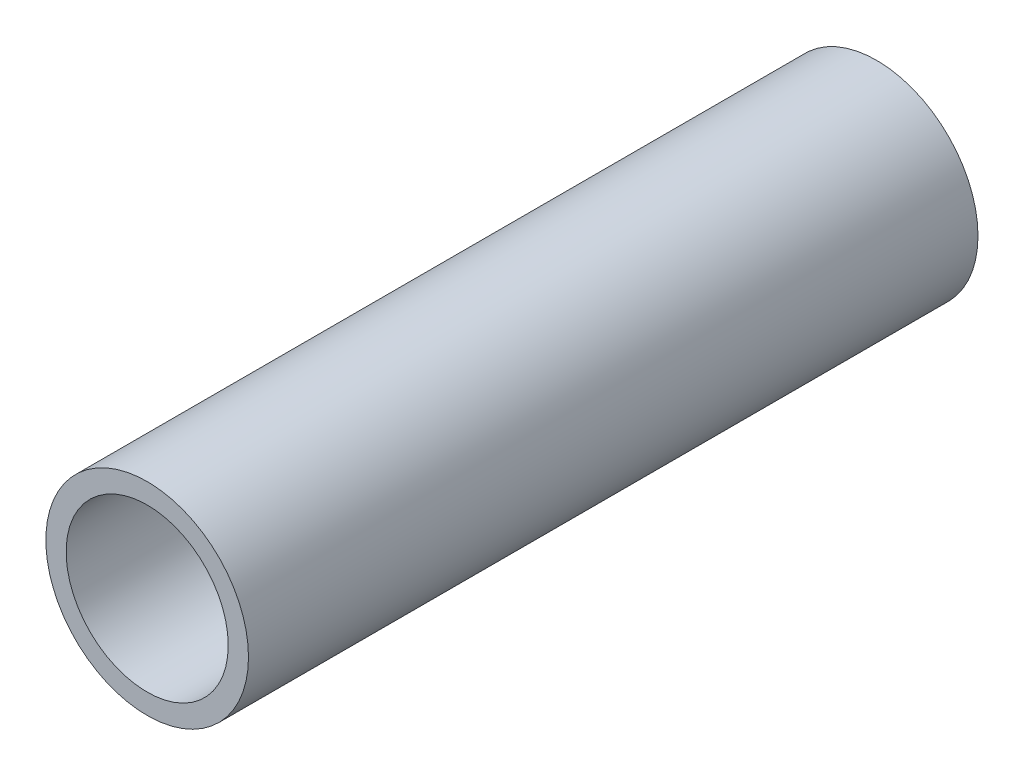
ISO-10303-21;
HEADER;
FILE_DESCRIPTION(('STEP AP214'),'2;1');
FILE_NAME('part.step','',(''),(''),'','','');
FILE_SCHEMA(('AUTOMOTIVE_DESIGN { 1 0 10303 214 1 1 1 1 }'));
ENDSEC;
DATA;
#1=APPLICATION_CONTEXT('core data for automotive mechanical design processes');
#2=APPLICATION_PROTOCOL_DEFINITION('international standard','automotive_design',2000,#1);
#3=PRODUCT_CONTEXT('',#1,'mechanical');
#4=PRODUCT('Part','Part','',(#3));
#5=PRODUCT_RELATED_PRODUCT_CATEGORY('part','',(#4));
#6=PRODUCT_DEFINITION_FORMATION('','',#4);
#7=PRODUCT_DEFINITION_CONTEXT('part definition',#1,'design');
#8=PRODUCT_DEFINITION('design','',#6,#7);
#9=PRODUCT_DEFINITION_SHAPE('','',#8);
#10=(LENGTH_UNIT() NAMED_UNIT(*) SI_UNIT(.MILLI.,.METRE.));
#11=(NAMED_UNIT(*) PLANE_ANGLE_UNIT() SI_UNIT($,.RADIAN.));
#12=(NAMED_UNIT(*) SI_UNIT($,.STERADIAN.) SOLID_ANGLE_UNIT());
#13=UNCERTAINTY_MEASURE_WITH_UNIT(LENGTH_MEASURE(1.E-05),#10,'distance_accuracy_value','');
#14=(GEOMETRIC_REPRESENTATION_CONTEXT(3) GLOBAL_UNCERTAINTY_ASSIGNED_CONTEXT((#13)) GLOBAL_UNIT_ASSIGNED_CONTEXT((#10,
#11,#12)) REPRESENTATION_CONTEXT('',''));
#15=CARTESIAN_POINT('',(0.,0.,0.));
#16=DIRECTION('',(0.,0.,1.));
#17=DIRECTION('',(1.,0.,0.));
#18=AXIS2_PLACEMENT_3D('',#15,#16,#17);
#19=CARTESIAN_POINT('',(0.,0.,9.));
#20=DIRECTION('',(0.,0.,1.));
#21=DIRECTION('',(1.,0.,0.));
#22=AXIS2_PLACEMENT_3D('',#19,#20,#21);
#23=PLANE('',#22);
#24=CARTESIAN_POINT('',(0.,0.,9.));
#25=DIRECTION('',(0.,0.,1.));
#26=DIRECTION('',(1.,0.,0.));
#27=AXIS2_PLACEMENT_3D('',#24,#25,#26);
#28=CIRCLE('',#27,1.25);
#29=CARTESIAN_POINT('',(1.25,0.,9.));
#30=VERTEX_POINT('',#29);
#31=EDGE_CURVE('E10',#30,#30,#28,.T.);
#32=ORIENTED_EDGE('',*,*,#31,.T.);
#33=EDGE_LOOP('',(#32));
#34=FACE_BOUND('',#33,.T.);
#35=CARTESIAN_POINT('',(0.,0.,9.));
#36=DIRECTION('',(0.,0.,1.));
#37=DIRECTION('',(1.,0.,0.));
#38=AXIS2_PLACEMENT_3D('',#35,#36,#37);
#39=CIRCLE('',#38,1.);
#40=CARTESIAN_POINT('',(1.,0.,9.));
#41=VERTEX_POINT('',#40);
#42=EDGE_CURVE('E41',#41,#41,#39,.T.);
#43=ORIENTED_EDGE('',*,*,#42,.F.);
#44=EDGE_LOOP('',(#43));
#45=FACE_BOUND('',#44,.T.);
#46=ADVANCED_FACE('F30',(#34,#45),#23,.T.);
#47=CARTESIAN_POINT('',(0.,0.,0.));
#48=DIRECTION('',(0.,0.,1.));
#49=DIRECTION('',(1.,0.,0.));
#50=AXIS2_PLACEMENT_3D('',#47,#48,#49);
#51=PLANE('',#50);
#52=CARTESIAN_POINT('',(0.,0.,0.));
#53=DIRECTION('',(0.,0.,1.));
#54=DIRECTION('',(1.,0.,0.));
#55=AXIS2_PLACEMENT_3D('',#52,#53,#54);
#56=CIRCLE('',#55,1.25);
#57=CARTESIAN_POINT('',(1.25,0.,0.));
#58=VERTEX_POINT('',#57);
#59=EDGE_CURVE('E34',#58,#58,#56,.T.);
#60=ORIENTED_EDGE('',*,*,#59,.F.);
#61=EDGE_LOOP('',(#60));
#62=FACE_BOUND('',#61,.T.);
#63=CARTESIAN_POINT('',(0.,0.,0.));
#64=DIRECTION('',(0.,0.,1.));
#65=DIRECTION('',(1.,0.,0.));
#66=AXIS2_PLACEMENT_3D('',#63,#64,#65);
#67=CIRCLE('',#66,1.);
#68=CARTESIAN_POINT('',(1.,0.,0.));
#69=VERTEX_POINT('',#68);
#70=EDGE_CURVE('E43',#69,#69,#67,.T.);
#71=ORIENTED_EDGE('',*,*,#70,.T.);
#72=EDGE_LOOP('',(#71));
#73=FACE_BOUND('',#72,.T.);
#74=ADVANCED_FACE('F53',(#62,#73),#51,.F.);
#75=CARTESIAN_POINT('',(0.,0.,9.));
#76=DIRECTION('',(0.,0.,-1.));
#77=DIRECTION('',(-1.,0.,0.));
#78=AXIS2_PLACEMENT_3D('',#75,#76,#77);
#79=CYLINDRICAL_SURFACE('',#78,1.25);
#80=ORIENTED_EDGE('',*,*,#31,.F.);
#81=EDGE_LOOP('',(#80));
#82=FACE_BOUND('',#81,.T.);
#83=ORIENTED_EDGE('',*,*,#59,.T.);
#84=EDGE_LOOP('',(#83));
#85=FACE_BOUND('',#84,.T.);
#86=ADVANCED_FACE('F32',(#82,#85),#79,.T.);
#87=CARTESIAN_POINT('',(0.,0.,9.));
#88=DIRECTION('',(0.,0.,-1.));
#89=DIRECTION('',(-1.,0.,0.));
#90=AXIS2_PLACEMENT_3D('',#87,#88,#89);
#91=CYLINDRICAL_SURFACE('',#90,1.);
#92=ORIENTED_EDGE('',*,*,#42,.T.);
#93=EDGE_LOOP('',(#92));
#94=FACE_BOUND('',#93,.T.);
#95=ORIENTED_EDGE('',*,*,#70,.F.);
#96=EDGE_LOOP('',(#95));
#97=FACE_BOUND('',#96,.T.);
#98=ADVANCED_FACE('F49',(#94,#97),#91,.F.);
#99=CLOSED_SHELL('',(#46,#74,#86,#98));
#100=MANIFOLD_SOLID_BREP('B2',#99);
#101=ADVANCED_BREP_SHAPE_REPRESENTATION('',(#18,#100),#14);
#102=SHAPE_DEFINITION_REPRESENTATION(#9,#101);
ENDSEC;
END-ISO-10303-21;
